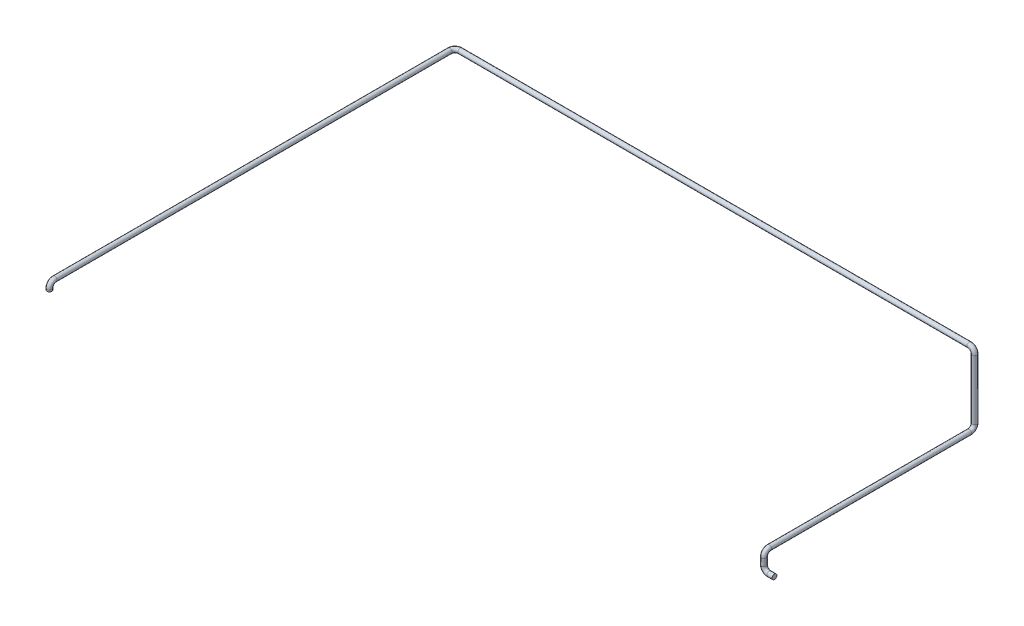
ISO-10303-21;
HEADER;
FILE_DESCRIPTION(('STEP AP214'),'2;1');
FILE_NAME('part.step','',(''),(''),'','','');
FILE_SCHEMA(('AUTOMOTIVE_DESIGN { 1 0 10303 214 1 1 1 1 }'));
ENDSEC;
DATA;
#1=APPLICATION_CONTEXT('core data for automotive mechanical design processes');
#2=APPLICATION_PROTOCOL_DEFINITION('international standard','automotive_design',2000,#1);
#3=PRODUCT_CONTEXT('',#1,'mechanical');
#4=PRODUCT('Part','Part','',(#3));
#5=PRODUCT_RELATED_PRODUCT_CATEGORY('part','',(#4));
#6=PRODUCT_DEFINITION_FORMATION('','',#4);
#7=PRODUCT_DEFINITION_CONTEXT('part definition',#1,'design');
#8=PRODUCT_DEFINITION('design','',#6,#7);
#9=PRODUCT_DEFINITION_SHAPE('','',#8);
#10=(LENGTH_UNIT() NAMED_UNIT(*) SI_UNIT(.MILLI.,.METRE.));
#11=(NAMED_UNIT(*) PLANE_ANGLE_UNIT() SI_UNIT($,.RADIAN.));
#12=(NAMED_UNIT(*) SI_UNIT($,.STERADIAN.) SOLID_ANGLE_UNIT());
#13=UNCERTAINTY_MEASURE_WITH_UNIT(LENGTH_MEASURE(1.E-05),#10,'distance_accuracy_value','');
#14=(GEOMETRIC_REPRESENTATION_CONTEXT(3) GLOBAL_UNCERTAINTY_ASSIGNED_CONTEXT((#13)) GLOBAL_UNIT_ASSIGNED_CONTEXT((#10,
#11,#12)) REPRESENTATION_CONTEXT('',''));
#15=CARTESIAN_POINT('',(0.,0.,0.));
#16=DIRECTION('',(0.,0.,1.));
#17=DIRECTION('',(1.,0.,0.));
#18=AXIS2_PLACEMENT_3D('',#15,#16,#17);
#19=CARTESIAN_POINT('',(0.,0.,0.));
#20=DIRECTION('',(1.,0.,0.));
#21=DIRECTION('',(0.,0.,-1.));
#22=AXIS2_PLACEMENT_3D('',#19,#20,#21);
#23=PLANE('',#22);
#24=CARTESIAN_POINT('',(0.,0.,0.));
#25=DIRECTION('',(1.,0.,0.));
#26=DIRECTION('',(0.,0.,-1.));
#27=AXIS2_PLACEMENT_3D('',#24,#25,#26);
#28=CIRCLE('',#27,13.7);
#29=CARTESIAN_POINT('',(0.,0.,-13.7));
#30=VERTEX_POINT('',#29);
#31=EDGE_CURVE('E47',#30,#30,#28,.T.);
#32=ORIENTED_EDGE('',*,*,#31,.T.);
#33=EDGE_LOOP('',(#32));
#34=FACE_BOUND('',#33,.T.);
#35=ADVANCED_FACE('F35',(#34),#23,.T.);
#36=CARTESIAN_POINT('',(-3020.,460.,1110.));
#37=DIRECTION('',(0.,1.,0.));
#38=DIRECTION('',(-1.,0.,0.));
#39=AXIS2_PLACEMENT_3D('',#36,#37,#38);
#40=PLANE('',#39);
#41=CARTESIAN_POINT('',(-3020.,460.,1110.));
#42=DIRECTION('',(0.,1.,0.));
#43=DIRECTION('',(-1.,0.,0.));
#44=AXIS2_PLACEMENT_3D('',#41,#42,#43);
#45=CIRCLE('',#44,13.7);
#46=CARTESIAN_POINT('',(-3033.7,460.,1110.));
#47=VERTEX_POINT('',#46);
#48=EDGE_CURVE('E11',#47,#47,#45,.T.);
#49=ORIENTED_EDGE('',*,*,#48,.F.);
#50=EDGE_LOOP('',(#49));
#51=FACE_BOUND('',#50,.T.);
#52=ADVANCED_FACE('F53',(#51),#40,.F.);
#53=CARTESIAN_POINT('',(0.,0.,0.));
#54=DIRECTION('',(-1.,0.,0.));
#55=DIRECTION('',(0.,0.,1.));
#56=AXIS2_PLACEMENT_3D('',#53,#54,#55);
#57=CYLINDRICAL_SURFACE('',#56,13.7);
#58=CARTESIAN_POINT('',(-30.,0.,0.));
#59=DIRECTION('',(1.,0.,0.));
#60=DIRECTION('',(0.,0.,-1.));
#61=AXIS2_PLACEMENT_3D('',#58,#59,#60);
#62=CIRCLE('',#61,13.7);
#63=CARTESIAN_POINT('',(-30.,-13.7,0.));
#64=VERTEX_POINT('',#63);
#65=EDGE_CURVE('E119',#64,#64,#62,.T.);
#66=ORIENTED_EDGE('',*,*,#65,.T.);
#67=EDGE_LOOP('',(#66));
#68=FACE_BOUND('',#67,.T.);
#69=ORIENTED_EDGE('',*,*,#31,.F.);
#70=EDGE_LOOP('',(#69));
#71=FACE_BOUND('',#70,.T.);
#72=ADVANCED_FACE('F55',(#68,#71),#57,.T.);
#73=CARTESIAN_POINT('',(-30.,30.,0.));
#74=DIRECTION('',(0.,0.,-1.));
#75=DIRECTION('',(-1.,0.,0.));
#76=AXIS2_PLACEMENT_3D('',#73,#74,#75);
#77=TOROIDAL_SURFACE('',#76,30.,13.7);
#78=CARTESIAN_POINT('',(-60.,30.,0.));
#79=DIRECTION('',(0.,-1.,0.));
#80=DIRECTION('',(0.,0.,-1.));
#81=AXIS2_PLACEMENT_3D('',#78,#79,#80);
#82=CIRCLE('',#81,13.7);
#83=CARTESIAN_POINT('',(-73.7,30.,0.));
#84=VERTEX_POINT('',#83);
#85=EDGE_CURVE('E116',#84,#84,#82,.T.);
#86=CARTESIAN_POINT('',(-30.,30.,0.));
#87=DIRECTION('',(0.,0.,-1.));
#88=DIRECTION('',(-1.,0.,0.));
#89=AXIS2_PLACEMENT_3D('',#86,#87,#88);
#90=CIRCLE('',#89,43.7);
#91=EDGE_CURVE('',#64,#84,#90,.T.);
#92=ORIENTED_EDGE('',*,*,#65,.F.);
#93=ORIENTED_EDGE('',*,*,#85,.T.);
#94=ORIENTED_EDGE('',*,*,#91,.T.);
#95=ORIENTED_EDGE('',*,*,#91,.F.);
#96=EDGE_LOOP('',(#92,#94,#93,#95));
#97=FACE_BOUND('',#96,.T.);
#98=ADVANCED_FACE('F60',(#97),#77,.T.);
#99=CARTESIAN_POINT('',(-60.,30.,0.));
#100=DIRECTION('',(0.,1.,0.));
#101=DIRECTION('',(0.,0.,1.));
#102=AXIS2_PLACEMENT_3D('',#99,#100,#101);
#103=CYLINDRICAL_SURFACE('',#102,13.7);
#104=CARTESIAN_POINT('',(-60.,70.,0.));
#105=DIRECTION('',(0.,-1.,0.));
#106=DIRECTION('',(0.,0.,-1.));
#107=AXIS2_PLACEMENT_3D('',#104,#105,#106);
#108=CIRCLE('',#107,13.7);
#109=CARTESIAN_POINT('',(-60.,70.,13.7));
#110=VERTEX_POINT('',#109);
#111=EDGE_CURVE('E121',#110,#110,#108,.T.);
#112=ORIENTED_EDGE('',*,*,#111,.T.);
#113=EDGE_LOOP('',(#112));
#114=FACE_BOUND('',#113,.T.);
#115=ORIENTED_EDGE('',*,*,#85,.F.);
#116=EDGE_LOOP('',(#115));
#117=FACE_BOUND('',#116,.T.);
#118=ADVANCED_FACE('F104',(#114,#117),#103,.T.);
#119=CARTESIAN_POINT('',(-60.,70.,-30.));
#120=DIRECTION('',(-1.,0.,0.));
#121=DIRECTION('',(0.,0.,1.));
#122=AXIS2_PLACEMENT_3D('',#119,#120,#121);
#123=TOROIDAL_SURFACE('',#122,30.,13.7);
#124=CARTESIAN_POINT('',(-60.,100.,-30.));
#125=DIRECTION('',(0.,0.,1.));
#126=DIRECTION('',(0.,-1.,0.));
#127=AXIS2_PLACEMENT_3D('',#124,#125,#126);
#128=CIRCLE('',#127,13.7);
#129=CARTESIAN_POINT('',(-60.,113.7,-30.));
#130=VERTEX_POINT('',#129);
#131=EDGE_CURVE('E127',#130,#130,#128,.T.);
#132=CARTESIAN_POINT('',(-60.,70.,-30.));
#133=DIRECTION('',(-1.,0.,0.));
#134=DIRECTION('',(0.,0.,1.));
#135=AXIS2_PLACEMENT_3D('',#132,#133,#134);
#136=CIRCLE('',#135,43.7);
#137=EDGE_CURVE('',#110,#130,#136,.T.);
#138=ORIENTED_EDGE('',*,*,#111,.F.);
#139=ORIENTED_EDGE('',*,*,#131,.T.);
#140=ORIENTED_EDGE('',*,*,#137,.T.);
#141=ORIENTED_EDGE('',*,*,#137,.F.);
#142=EDGE_LOOP('',(#138,#140,#139,#141));
#143=FACE_BOUND('',#142,.T.);
#144=ADVANCED_FACE('F100',(#143),#123,.T.);
#145=CARTESIAN_POINT('',(-60.,100.,-30.));
#146=DIRECTION('',(0.,0.,-1.));
#147=DIRECTION('',(-1.,0.,0.));
#148=AXIS2_PLACEMENT_3D('',#145,#146,#147);
#149=CYLINDRICAL_SURFACE('',#148,13.7);
#150=CARTESIAN_POINT('',(-60.0000000000001,100.,-1170.));
#151=DIRECTION('',(0.,0.,1.));
#152=DIRECTION('',(0.,-1.,0.));
#153=AXIS2_PLACEMENT_3D('',#150,#151,#152);
#154=CIRCLE('',#153,13.7);
#155=CARTESIAN_POINT('',(-60.0000000000001,86.3,-1170.));
#156=VERTEX_POINT('',#155);
#157=EDGE_CURVE('E130',#156,#156,#154,.T.);
#158=ORIENTED_EDGE('',*,*,#157,.T.);
#159=EDGE_LOOP('',(#158));
#160=FACE_BOUND('',#159,.T.);
#161=ORIENTED_EDGE('',*,*,#131,.F.);
#162=EDGE_LOOP('',(#161));
#163=FACE_BOUND('',#162,.T.);
#164=ADVANCED_FACE('F96',(#160,#163),#149,.T.);
#165=CARTESIAN_POINT('',(-60.,130.,-1170.));
#166=DIRECTION('',(1.,0.,0.));
#167=DIRECTION('',(0.,0.,-1.));
#168=AXIS2_PLACEMENT_3D('',#165,#166,#167);
#169=TOROIDAL_SURFACE('',#168,30.,13.7);
#170=CARTESIAN_POINT('',(-60.,130.,-1200.));
#171=DIRECTION('',(0.,-1.,0.));
#172=DIRECTION('',(0.,0.,-1.));
#173=AXIS2_PLACEMENT_3D('',#170,#171,#172);
#174=CIRCLE('',#173,13.7);
#175=CARTESIAN_POINT('',(-60.,130.,-1213.7));
#176=VERTEX_POINT('',#175);
#177=EDGE_CURVE('E133',#176,#176,#174,.T.);
#178=CARTESIAN_POINT('',(-60.,130.,-1170.));
#179=DIRECTION('',(1.,0.,0.));
#180=DIRECTION('',(0.,0.,-1.));
#181=AXIS2_PLACEMENT_3D('',#178,#179,#180);
#182=CIRCLE('',#181,43.7);
#183=EDGE_CURVE('',#156,#176,#182,.T.);
#184=ORIENTED_EDGE('',*,*,#157,.F.);
#185=ORIENTED_EDGE('',*,*,#177,.T.);
#186=ORIENTED_EDGE('',*,*,#183,.T.);
#187=ORIENTED_EDGE('',*,*,#183,.F.);
#188=EDGE_LOOP('',(#184,#186,#185,#187));
#189=FACE_BOUND('',#188,.T.);
#190=ADVANCED_FACE('F92',(#189),#169,.T.);
#191=CARTESIAN_POINT('',(-60.0000000000001,130.,-1200.));
#192=DIRECTION('',(0.,1.,0.));
#193=DIRECTION('',(-1.,0.,0.));
#194=AXIS2_PLACEMENT_3D('',#191,#192,#193);
#195=CYLINDRICAL_SURFACE('',#194,13.7);
#196=CARTESIAN_POINT('',(-60.0000000000001,470.,-1200.));
#197=DIRECTION('',(0.,-1.,0.));
#198=DIRECTION('',(0.,0.,-1.));
#199=AXIS2_PLACEMENT_3D('',#196,#197,#198);
#200=CIRCLE('',#199,13.7);
#201=CARTESIAN_POINT('',(-46.3,470.,-1200.));
#202=VERTEX_POINT('',#201);
#203=EDGE_CURVE('E136',#202,#202,#200,.T.);
#204=ORIENTED_EDGE('',*,*,#203,.T.);
#205=EDGE_LOOP('',(#204));
#206=FACE_BOUND('',#205,.T.);
#207=ORIENTED_EDGE('',*,*,#177,.F.);
#208=EDGE_LOOP('',(#207));
#209=FACE_BOUND('',#208,.T.);
#210=ADVANCED_FACE('F88',(#206,#209),#195,.T.);
#211=CARTESIAN_POINT('',(-90.0000000000001,470.,-1200.));
#212=DIRECTION('',(0.,0.,1.));
#213=DIRECTION('',(1.,0.,0.));
#214=AXIS2_PLACEMENT_3D('',#211,#212,#213);
#215=TOROIDAL_SURFACE('',#214,30.,13.7);
#216=CARTESIAN_POINT('',(-90.0000000000001,500.,-1200.));
#217=DIRECTION('',(1.,0.,0.));
#218=DIRECTION('',(0.,0.,-1.));
#219=AXIS2_PLACEMENT_3D('',#216,#217,#218);
#220=CIRCLE('',#219,13.7);
#221=CARTESIAN_POINT('',(-90.0000000000001,513.7,-1200.));
#222=VERTEX_POINT('',#221);
#223=EDGE_CURVE('E139',#222,#222,#220,.T.);
#224=CARTESIAN_POINT('',(-90.0000000000001,470.,-1200.));
#225=DIRECTION('',(0.,0.,1.));
#226=DIRECTION('',(1.,0.,0.));
#227=AXIS2_PLACEMENT_3D('',#224,#225,#226);
#228=CIRCLE('',#227,43.7);
#229=EDGE_CURVE('',#202,#222,#228,.T.);
#230=ORIENTED_EDGE('',*,*,#203,.F.);
#231=ORIENTED_EDGE('',*,*,#223,.T.);
#232=ORIENTED_EDGE('',*,*,#229,.T.);
#233=ORIENTED_EDGE('',*,*,#229,.F.);
#234=EDGE_LOOP('',(#230,#232,#231,#233));
#235=FACE_BOUND('',#234,.T.);
#236=ADVANCED_FACE('F84',(#235),#215,.T.);
#237=CARTESIAN_POINT('',(-90.0000000000001,500.,-1200.));
#238=DIRECTION('',(-1.,0.,0.));
#239=DIRECTION('',(0.,0.,1.));
#240=AXIS2_PLACEMENT_3D('',#237,#238,#239);
#241=CYLINDRICAL_SURFACE('',#240,13.7);
#242=CARTESIAN_POINT('',(-2990.,500.,-1200.));
#243=DIRECTION('',(1.,0.,0.));
#244=DIRECTION('',(0.,0.,-1.));
#245=AXIS2_PLACEMENT_3D('',#242,#243,#244);
#246=CIRCLE('',#245,13.7);
#247=CARTESIAN_POINT('',(-2990.,500.,-1213.7));
#248=VERTEX_POINT('',#247);
#249=EDGE_CURVE('E142',#248,#248,#246,.T.);
#250=ORIENTED_EDGE('',*,*,#249,.T.);
#251=EDGE_LOOP('',(#250));
#252=FACE_BOUND('',#251,.T.);
#253=ORIENTED_EDGE('',*,*,#223,.F.);
#254=EDGE_LOOP('',(#253));
#255=FACE_BOUND('',#254,.T.);
#256=ADVANCED_FACE('F80',(#252,#255),#241,.T.);
#257=CARTESIAN_POINT('',(-2990.,500.,-1170.));
#258=DIRECTION('',(0.,1.,0.));
#259=DIRECTION('',(0.,0.,1.));
#260=AXIS2_PLACEMENT_3D('',#257,#258,#259);
#261=TOROIDAL_SURFACE('',#260,29.9999999999998,13.7);
#262=CARTESIAN_POINT('',(-3020.,500.,-1170.));
#263=DIRECTION('',(0.,0.,-1.));
#264=DIRECTION('',(-1.,0.,0.));
#265=AXIS2_PLACEMENT_3D('',#262,#263,#264);
#266=CIRCLE('',#265,13.7);
#267=CARTESIAN_POINT('',(-3033.7,500.,-1170.));
#268=VERTEX_POINT('',#267);
#269=EDGE_CURVE('E145',#268,#268,#266,.T.);
#270=CARTESIAN_POINT('',(-2990.,500.,-1170.));
#271=DIRECTION('',(0.,1.,0.));
#272=DIRECTION('',(0.,0.,1.));
#273=AXIS2_PLACEMENT_3D('',#270,#271,#272);
#274=CIRCLE('',#273,43.6999999999998);
#275=EDGE_CURVE('',#248,#268,#274,.T.);
#276=ORIENTED_EDGE('',*,*,#249,.F.);
#277=ORIENTED_EDGE('',*,*,#269,.T.);
#278=ORIENTED_EDGE('',*,*,#275,.T.);
#279=ORIENTED_EDGE('',*,*,#275,.F.);
#280=EDGE_LOOP('',(#276,#278,#277,#279));
#281=FACE_BOUND('',#280,.T.);
#282=ADVANCED_FACE('F76',(#281),#261,.T.);
#283=CARTESIAN_POINT('',(-3020.,500.,-1170.));
#284=DIRECTION('',(0.,0.,1.));
#285=DIRECTION('',(1.,0.,0.));
#286=AXIS2_PLACEMENT_3D('',#283,#284,#285);
#287=CYLINDRICAL_SURFACE('',#286,13.7);
#288=CARTESIAN_POINT('',(-3020.,500.,1080.));
#289=DIRECTION('',(0.,0.,-1.));
#290=DIRECTION('',(-1.,0.,0.));
#291=AXIS2_PLACEMENT_3D('',#288,#289,#290);
#292=CIRCLE('',#291,13.7);
#293=CARTESIAN_POINT('',(-3020.,513.7,1080.));
#294=VERTEX_POINT('',#293);
#295=EDGE_CURVE('E148',#294,#294,#292,.T.);
#296=ORIENTED_EDGE('',*,*,#295,.T.);
#297=EDGE_LOOP('',(#296));
#298=FACE_BOUND('',#297,.T.);
#299=ORIENTED_EDGE('',*,*,#269,.F.);
#300=EDGE_LOOP('',(#299));
#301=FACE_BOUND('',#300,.T.);
#302=ADVANCED_FACE('F70',(#298,#301),#287,.T.);
#303=CARTESIAN_POINT('',(-3020.,470.,1080.));
#304=DIRECTION('',(1.,0.,0.));
#305=DIRECTION('',(0.,0.,-1.));
#306=AXIS2_PLACEMENT_3D('',#303,#304,#305);
#307=TOROIDAL_SURFACE('',#306,30.,13.7);
#308=CARTESIAN_POINT('',(-3020.,470.,1110.));
#309=DIRECTION('',(0.,1.,0.));
#310=DIRECTION('',(-1.,0.,0.));
#311=AXIS2_PLACEMENT_3D('',#308,#309,#310);
#312=CIRCLE('',#311,13.7);
#313=CARTESIAN_POINT('',(-3020.,470.,1123.7));
#314=VERTEX_POINT('',#313);
#315=EDGE_CURVE('E42',#314,#314,#312,.T.);
#316=CARTESIAN_POINT('',(-3020.,470.,1080.));
#317=DIRECTION('',(1.,0.,0.));
#318=DIRECTION('',(0.,0.,-1.));
#319=AXIS2_PLACEMENT_3D('',#316,#317,#318);
#320=CIRCLE('',#319,43.7);
#321=EDGE_CURVE('',#294,#314,#320,.T.);
#322=ORIENTED_EDGE('',*,*,#295,.F.);
#323=ORIENTED_EDGE('',*,*,#315,.T.);
#324=ORIENTED_EDGE('',*,*,#321,.T.);
#325=ORIENTED_EDGE('',*,*,#321,.F.);
#326=EDGE_LOOP('',(#322,#324,#323,#325));
#327=FACE_BOUND('',#326,.T.);
#328=ADVANCED_FACE('F66',(#327),#307,.T.);
#329=CARTESIAN_POINT('',(-3020.,470.,1110.));
#330=DIRECTION('',(0.,-1.,0.));
#331=DIRECTION('',(0.,0.,-1.));
#332=AXIS2_PLACEMENT_3D('',#329,#330,#331);
#333=CYLINDRICAL_SURFACE('',#332,13.7);
#334=ORIENTED_EDGE('',*,*,#48,.T.);
#335=EDGE_LOOP('',(#334));
#336=FACE_BOUND('',#335,.T.);
#337=ORIENTED_EDGE('',*,*,#315,.F.);
#338=EDGE_LOOP('',(#337));
#339=FACE_BOUND('',#338,.T.);
#340=ADVANCED_FACE('F50',(#336,#339),#333,.T.);
#341=CLOSED_SHELL('',(#35,#52,#72,#98,#118,#144,#164,#190,#210,#236,#256,#282,#302,#328,#340));
#342=MANIFOLD_SOLID_BREP('B2',#341);
#343=ADVANCED_BREP_SHAPE_REPRESENTATION('',(#18,#342),#14);
#344=SHAPE_DEFINITION_REPRESENTATION(#9,#343);
ENDSEC;
END-ISO-10303-21;
